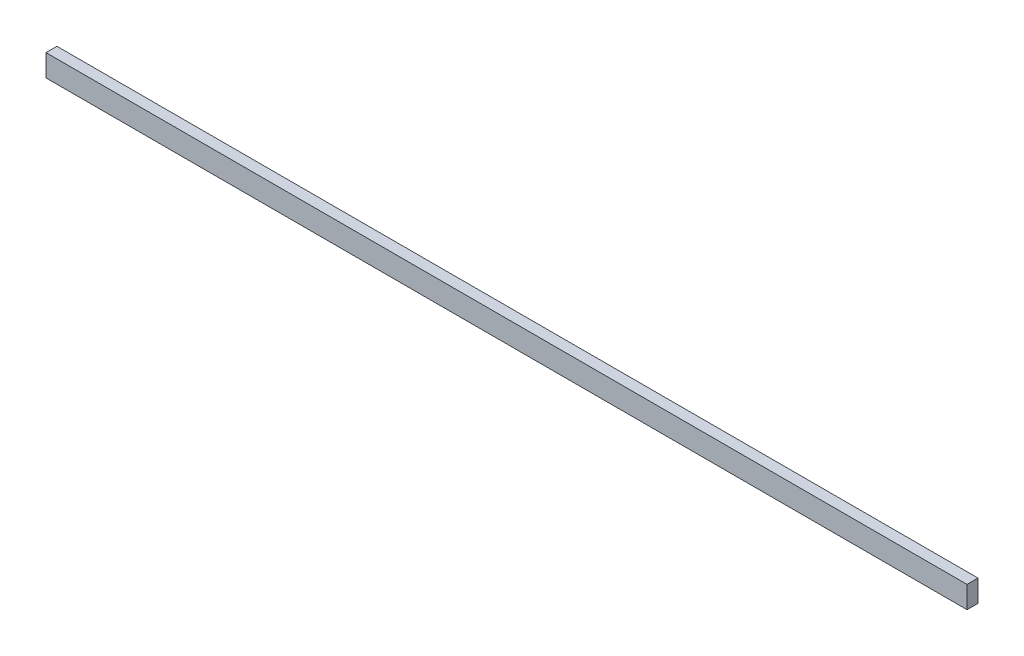
ISO-10303-21;
HEADER;
FILE_DESCRIPTION(('STEP AP214'),'2;1');
FILE_NAME('part.step','',(''),(''),'','','');
FILE_SCHEMA(('AUTOMOTIVE_DESIGN { 1 0 10303 214 1 1 1 1 }'));
ENDSEC;
DATA;
#1=APPLICATION_CONTEXT('core data for automotive mechanical design processes');
#2=APPLICATION_PROTOCOL_DEFINITION('international standard','automotive_design',2000,#1);
#3=PRODUCT_CONTEXT('',#1,'mechanical');
#4=PRODUCT('Part','Part','',(#3));
#5=PRODUCT_RELATED_PRODUCT_CATEGORY('part','',(#4));
#6=PRODUCT_DEFINITION_FORMATION('','',#4);
#7=PRODUCT_DEFINITION_CONTEXT('part definition',#1,'design');
#8=PRODUCT_DEFINITION('design','',#6,#7);
#9=PRODUCT_DEFINITION_SHAPE('','',#8);
#10=(LENGTH_UNIT() NAMED_UNIT(*) SI_UNIT(.MILLI.,.METRE.));
#11=(NAMED_UNIT(*) PLANE_ANGLE_UNIT() SI_UNIT($,.RADIAN.));
#12=(NAMED_UNIT(*) SI_UNIT($,.STERADIAN.) SOLID_ANGLE_UNIT());
#13=UNCERTAINTY_MEASURE_WITH_UNIT(LENGTH_MEASURE(1.E-05),#10,'distance_accuracy_value','');
#14=(GEOMETRIC_REPRESENTATION_CONTEXT(3) GLOBAL_UNCERTAINTY_ASSIGNED_CONTEXT((#13)) GLOBAL_UNIT_ASSIGNED_CONTEXT((#10,
#11,#12)) REPRESENTATION_CONTEXT('',''));
#15=CARTESIAN_POINT('',(0.,0.,0.));
#16=DIRECTION('',(0.,0.,1.));
#17=DIRECTION('',(1.,0.,0.));
#18=AXIS2_PLACEMENT_3D('',#15,#16,#17);
#19=CARTESIAN_POINT('',(0.,50.8,0.));
#20=DIRECTION('',(1.,0.,0.));
#21=DIRECTION('',(0.,0.,-1.));
#22=AXIS2_PLACEMENT_3D('',#19,#20,#21);
#23=PLANE('',#22);
#24=DIRECTION('',(0.,0.,1.));
#25=VECTOR('',#24,1.);
#26=CARTESIAN_POINT('',(0.,0.,0.));
#27=LINE('',#26,#25);
#28=CARTESIAN_POINT('',(0.,0.,-25.3999999999999));
#29=VERTEX_POINT('',#28);
#30=CARTESIAN_POINT('',(0.,0.,0.));
#31=VERTEX_POINT('',#30);
#32=EDGE_CURVE('E97',#29,#31,#27,.T.);
#33=ORIENTED_EDGE('',*,*,#32,.T.);
#34=DIRECTION('',(0.,-1.,0.));
#35=VECTOR('',#34,1.);
#36=CARTESIAN_POINT('',(0.,50.8,0.));
#37=LINE('',#36,#35);
#38=CARTESIAN_POINT('',(0.,50.8,0.));
#39=VERTEX_POINT('',#38);
#40=EDGE_CURVE('E11',#39,#31,#37,.T.);
#41=ORIENTED_EDGE('',*,*,#40,.F.);
#42=DIRECTION('',(0.,0.,1.));
#43=VECTOR('',#42,1.);
#44=CARTESIAN_POINT('',(0.,50.8,0.));
#45=LINE('',#44,#43);
#46=CARTESIAN_POINT('',(0.,50.8,-25.3999999999999));
#47=VERTEX_POINT('',#46);
#48=EDGE_CURVE('E85',#47,#39,#45,.T.);
#49=ORIENTED_EDGE('',*,*,#48,.F.);
#50=DIRECTION('',(0.,-1.,0.));
#51=VECTOR('',#50,1.);
#52=CARTESIAN_POINT('',(0.,50.8,-25.3999999999999));
#53=LINE('',#52,#51);
#54=EDGE_CURVE('E93',#47,#29,#53,.T.);
#55=ORIENTED_EDGE('',*,*,#54,.T.);
#56=EDGE_LOOP('',(#33,#41,#49,#55));
#57=FACE_BOUND('',#56,.T.);
#58=ADVANCED_FACE('F34',(#57),#23,.F.);
#59=CARTESIAN_POINT('',(0.,50.8,0.));
#60=DIRECTION('',(0.,0.,-1.));
#61=DIRECTION('',(-1.,0.,0.));
#62=AXIS2_PLACEMENT_3D('',#59,#60,#61);
#63=PLANE('',#62);
#64=DIRECTION('',(1.,0.,0.));
#65=VECTOR('',#64,1.);
#66=CARTESIAN_POINT('',(0.,0.,0.));
#67=LINE('',#66,#65);
#68=CARTESIAN_POINT('',(2133.6,0.,0.));
#69=VERTEX_POINT('',#68);
#70=EDGE_CURVE('E89',#31,#69,#67,.T.);
#71=ORIENTED_EDGE('',*,*,#70,.T.);
#72=DIRECTION('',(0.,-1.,0.));
#73=VECTOR('',#72,1.);
#74=CARTESIAN_POINT('',(2133.6,50.8,0.));
#75=LINE('',#74,#73);
#76=CARTESIAN_POINT('',(2133.6,50.8,0.));
#77=VERTEX_POINT('',#76);
#78=EDGE_CURVE('E42',#77,#69,#75,.T.);
#79=ORIENTED_EDGE('',*,*,#78,.F.);
#80=DIRECTION('',(1.,0.,0.));
#81=VECTOR('',#80,1.);
#82=CARTESIAN_POINT('',(0.,50.8,0.));
#83=LINE('',#82,#81);
#84=EDGE_CURVE('E80',#39,#77,#83,.T.);
#85=ORIENTED_EDGE('',*,*,#84,.F.);
#86=ORIENTED_EDGE('',*,*,#40,.T.);
#87=EDGE_LOOP('',(#71,#79,#85,#86));
#88=FACE_BOUND('',#87,.T.);
#89=ADVANCED_FACE('F88',(#88),#63,.F.);
#90=CARTESIAN_POINT('',(2133.6,50.8,0.));
#91=DIRECTION('',(-1.,0.,0.));
#92=DIRECTION('',(0.,0.,1.));
#93=AXIS2_PLACEMENT_3D('',#90,#91,#92);
#94=PLANE('',#93);
#95=DIRECTION('',(0.,0.,-1.));
#96=VECTOR('',#95,1.);
#97=CARTESIAN_POINT('',(2133.6,0.,0.));
#98=LINE('',#97,#96);
#99=CARTESIAN_POINT('',(2133.6,0.,-25.3999999999999));
#100=VERTEX_POINT('',#99);
#101=EDGE_CURVE('E67',#69,#100,#98,.T.);
#102=ORIENTED_EDGE('',*,*,#101,.T.);
#103=DIRECTION('',(0.,-1.,0.));
#104=VECTOR('',#103,1.);
#105=CARTESIAN_POINT('',(2133.6,50.8,-25.3999999999999));
#106=LINE('',#105,#104);
#107=CARTESIAN_POINT('',(2133.6,50.8,-25.3999999999999));
#108=VERTEX_POINT('',#107);
#109=EDGE_CURVE('E90',#108,#100,#106,.T.);
#110=ORIENTED_EDGE('',*,*,#109,.F.);
#111=DIRECTION('',(0.,0.,-1.));
#112=VECTOR('',#111,1.);
#113=CARTESIAN_POINT('',(2133.6,50.8,0.));
#114=LINE('',#113,#112);
#115=EDGE_CURVE('E83',#77,#108,#114,.T.);
#116=ORIENTED_EDGE('',*,*,#115,.F.);
#117=ORIENTED_EDGE('',*,*,#78,.T.);
#118=EDGE_LOOP('',(#102,#110,#116,#117));
#119=FACE_BOUND('',#118,.T.);
#120=ADVANCED_FACE('F91',(#119),#94,.F.);
#121=CARTESIAN_POINT('',(0.,50.8,-25.3999999999999));
#122=DIRECTION('',(0.,0.,1.));
#123=DIRECTION('',(1.,0.,0.));
#124=AXIS2_PLACEMENT_3D('',#121,#122,#123);
#125=PLANE('',#124);
#126=DIRECTION('',(-1.,0.,0.));
#127=VECTOR('',#126,1.);
#128=CARTESIAN_POINT('',(0.,0.,-25.3999999999999));
#129=LINE('',#128,#127);
#130=EDGE_CURVE('E73',#100,#29,#129,.T.);
#131=ORIENTED_EDGE('',*,*,#130,.T.);
#132=ORIENTED_EDGE('',*,*,#54,.F.);
#133=DIRECTION('',(-1.,0.,0.));
#134=VECTOR('',#133,1.);
#135=CARTESIAN_POINT('',(0.,50.8,-25.3999999999999));
#136=LINE('',#135,#134);
#137=EDGE_CURVE('E50',#108,#47,#136,.T.);
#138=ORIENTED_EDGE('',*,*,#137,.F.);
#139=ORIENTED_EDGE('',*,*,#109,.T.);
#140=EDGE_LOOP('',(#131,#132,#138,#139));
#141=FACE_BOUND('',#140,.T.);
#142=ADVANCED_FACE('F104',(#141),#125,.F.);
#143=CARTESIAN_POINT('',(0.,50.8,0.));
#144=DIRECTION('',(0.,-1.,0.));
#145=DIRECTION('',(0.,0.,-1.));
#146=AXIS2_PLACEMENT_3D('',#143,#144,#145);
#147=PLANE('',#146);
#148=ORIENTED_EDGE('',*,*,#48,.T.);
#149=ORIENTED_EDGE('',*,*,#84,.T.);
#150=ORIENTED_EDGE('',*,*,#115,.T.);
#151=ORIENTED_EDGE('',*,*,#137,.T.);
#152=EDGE_LOOP('',(#148,#149,#150,#151));
#153=FACE_BOUND('',#152,.T.);
#154=ADVANCED_FACE('F81',(#153),#147,.F.);
#155=CARTESIAN_POINT('',(0.,0.,0.));
#156=DIRECTION('',(0.,-1.,0.));
#157=DIRECTION('',(0.,0.,-1.));
#158=AXIS2_PLACEMENT_3D('',#155,#156,#157);
#159=PLANE('',#158);
#160=ORIENTED_EDGE('',*,*,#32,.F.);
#161=ORIENTED_EDGE('',*,*,#130,.F.);
#162=ORIENTED_EDGE('',*,*,#101,.F.);
#163=ORIENTED_EDGE('',*,*,#70,.F.);
#164=EDGE_LOOP('',(#160,#161,#162,#163));
#165=FACE_BOUND('',#164,.T.);
#166=ADVANCED_FACE('F107',(#165),#159,.T.);
#167=CLOSED_SHELL('',(#58,#89,#120,#142,#154,#166));
#168=MANIFOLD_SOLID_BREP('B2',#167);
#169=ADVANCED_BREP_SHAPE_REPRESENTATION('',(#18,#168),#14);
#170=SHAPE_DEFINITION_REPRESENTATION(#9,#169);
ENDSEC;
END-ISO-10303-21;
